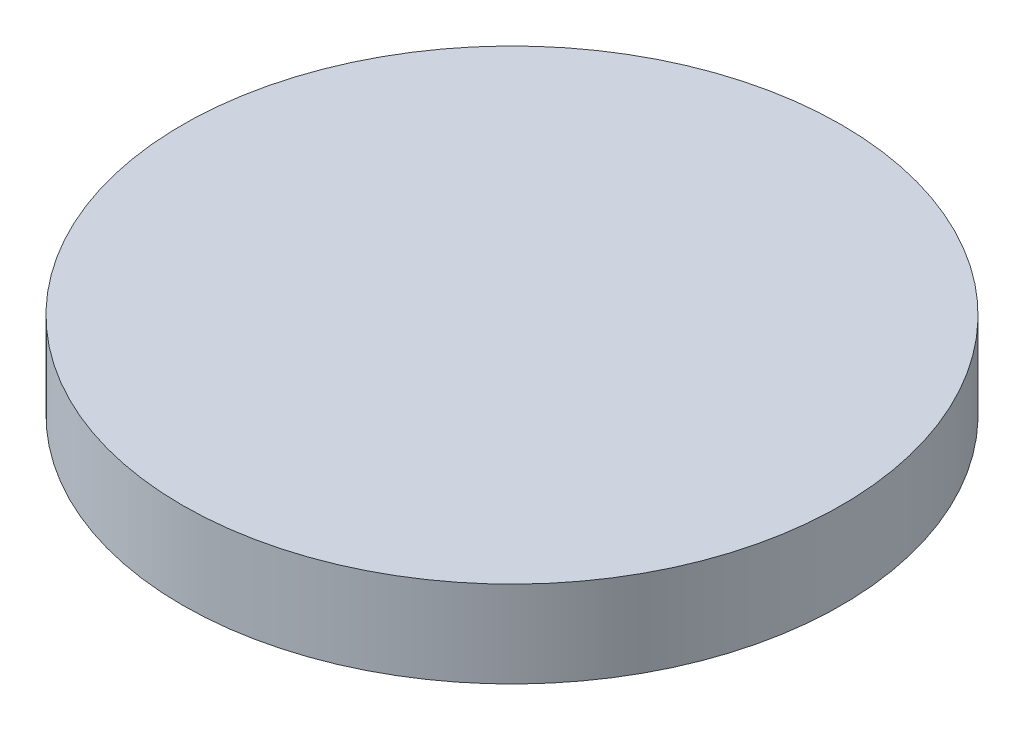
ISO-10303-21;
HEADER;
FILE_DESCRIPTION(('STEP AP214'),'2;1');
FILE_NAME('part.step','',(''),(''),'','','');
FILE_SCHEMA(('AUTOMOTIVE_DESIGN { 1 0 10303 214 1 1 1 1 }'));
ENDSEC;
DATA;
#1=APPLICATION_CONTEXT('core data for automotive mechanical design processes');
#2=APPLICATION_PROTOCOL_DEFINITION('international standard','automotive_design',2000,#1);
#3=PRODUCT_CONTEXT('',#1,'mechanical');
#4=PRODUCT('Part','Part','',(#3));
#5=PRODUCT_RELATED_PRODUCT_CATEGORY('part','',(#4));
#6=PRODUCT_DEFINITION_FORMATION('','',#4);
#7=PRODUCT_DEFINITION_CONTEXT('part definition',#1,'design');
#8=PRODUCT_DEFINITION('design','',#6,#7);
#9=PRODUCT_DEFINITION_SHAPE('','',#8);
#10=(LENGTH_UNIT() NAMED_UNIT(*) SI_UNIT(.MILLI.,.METRE.));
#11=(NAMED_UNIT(*) PLANE_ANGLE_UNIT() SI_UNIT($,.RADIAN.));
#12=(NAMED_UNIT(*) SI_UNIT($,.STERADIAN.) SOLID_ANGLE_UNIT());
#13=UNCERTAINTY_MEASURE_WITH_UNIT(LENGTH_MEASURE(1.E-05),#10,'distance_accuracy_value','');
#14=(GEOMETRIC_REPRESENTATION_CONTEXT(3) GLOBAL_UNCERTAINTY_ASSIGNED_CONTEXT((#13)) GLOBAL_UNIT_ASSIGNED_CONTEXT((#10,
#11,#12)) REPRESENTATION_CONTEXT('',''));
#15=CARTESIAN_POINT('',(0.,0.,0.));
#16=DIRECTION('',(0.,0.,1.));
#17=DIRECTION('',(1.,0.,0.));
#18=AXIS2_PLACEMENT_3D('',#15,#16,#17);
#19=CARTESIAN_POINT('',(0.,20.,0.));
#20=DIRECTION('',(0.,-1.,0.));
#21=DIRECTION('',(0.,0.,-1.));
#22=AXIS2_PLACEMENT_3D('',#19,#20,#21);
#23=CYLINDRICAL_SURFACE('',#22,76.2);
#24=CARTESIAN_POINT('',(0.,20.,0.));
#25=DIRECTION('',(0.,1.,0.));
#26=DIRECTION('',(0.,0.,1.));
#27=AXIS2_PLACEMENT_3D('',#24,#25,#26);
#28=CIRCLE('',#27,76.2);
#29=CARTESIAN_POINT('',(0.,20.,76.2));
#30=VERTEX_POINT('',#29);
#31=EDGE_CURVE('E10',#30,#30,#28,.T.);
#32=ORIENTED_EDGE('',*,*,#31,.F.);
#33=EDGE_LOOP('',(#32));
#34=FACE_BOUND('',#33,.T.);
#35=CARTESIAN_POINT('',(0.,0.,0.));
#36=DIRECTION('',(0.,1.,0.));
#37=DIRECTION('',(0.,0.,1.));
#38=AXIS2_PLACEMENT_3D('',#35,#36,#37);
#39=CIRCLE('',#38,76.2);
#40=CARTESIAN_POINT('',(0.,0.,76.2));
#41=VERTEX_POINT('',#40);
#42=EDGE_CURVE('E34',#41,#41,#39,.T.);
#43=ORIENTED_EDGE('',*,*,#42,.T.);
#44=EDGE_LOOP('',(#43));
#45=FACE_BOUND('',#44,.T.);
#46=ADVANCED_FACE('F31',(#34,#45),#23,.T.);
#47=CARTESIAN_POINT('',(0.,20.,0.));
#48=DIRECTION('',(0.,1.,0.));
#49=DIRECTION('',(0.,0.,1.));
#50=AXIS2_PLACEMENT_3D('',#47,#48,#49);
#51=PLANE('',#50);
#52=ORIENTED_EDGE('',*,*,#31,.T.);
#53=EDGE_LOOP('',(#52));
#54=FACE_BOUND('',#53,.T.);
#55=ADVANCED_FACE('F46',(#54),#51,.T.);
#56=CARTESIAN_POINT('',(0.,0.,0.));
#57=DIRECTION('',(0.,1.,0.));
#58=DIRECTION('',(0.,0.,1.));
#59=AXIS2_PLACEMENT_3D('',#56,#57,#58);
#60=PLANE('',#59);
#61=ORIENTED_EDGE('',*,*,#42,.F.);
#62=EDGE_LOOP('',(#61));
#63=FACE_BOUND('',#62,.T.);
#64=ADVANCED_FACE('F44',(#63),#60,.F.);
#65=CLOSED_SHELL('',(#46,#55,#64));
#66=MANIFOLD_SOLID_BREP('B2',#65);
#67=ADVANCED_BREP_SHAPE_REPRESENTATION('',(#18,#66),#14);
#68=SHAPE_DEFINITION_REPRESENTATION(#9,#67);
ENDSEC;
END-ISO-10303-21;
